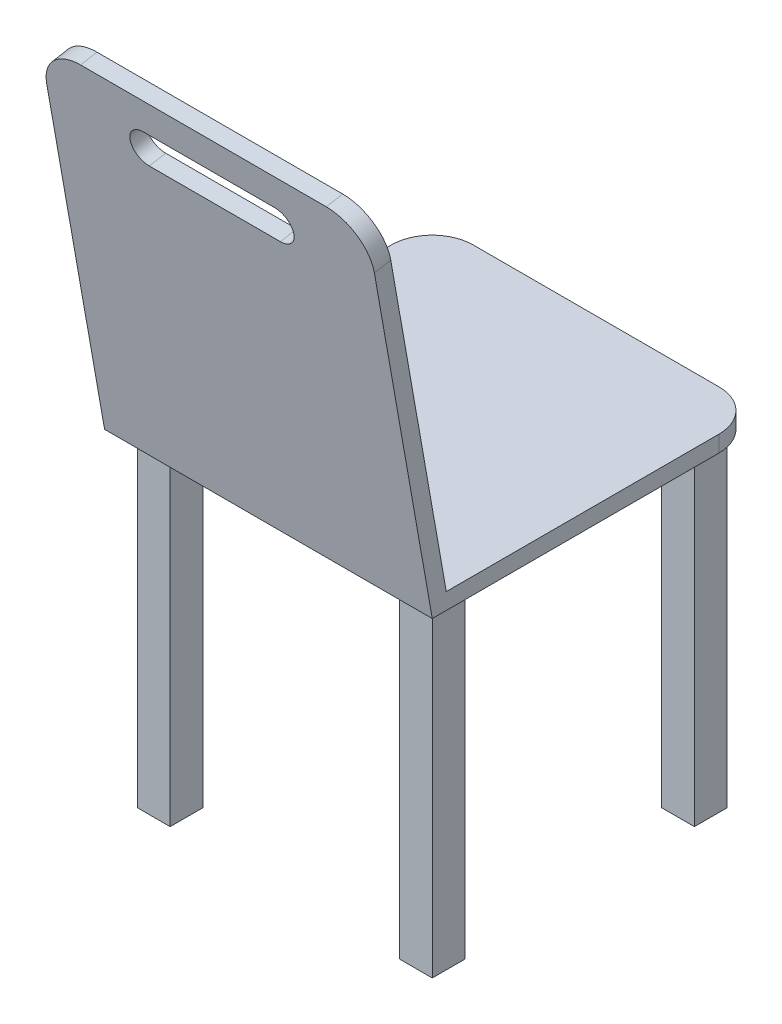
ISO-10303-21;
HEADER;
FILE_DESCRIPTION(('STEP AP214'),'2;1');
FILE_NAME('part.step','',(''),(''),'','','');
FILE_SCHEMA(('AUTOMOTIVE_DESIGN { 1 0 10303 214 1 1 1 1 }'));
ENDSEC;
DATA;
#1=APPLICATION_CONTEXT('core data for automotive mechanical design processes');
#2=APPLICATION_PROTOCOL_DEFINITION('international standard','automotive_design',2000,#1);
#3=PRODUCT_CONTEXT('',#1,'mechanical');
#4=PRODUCT('Part','Part','',(#3));
#5=PRODUCT_RELATED_PRODUCT_CATEGORY('part','',(#4));
#6=PRODUCT_DEFINITION_FORMATION('','',#4);
#7=PRODUCT_DEFINITION_CONTEXT('part definition',#1,'design');
#8=PRODUCT_DEFINITION('design','',#6,#7);
#9=PRODUCT_DEFINITION_SHAPE('','',#8);
#10=(LENGTH_UNIT() NAMED_UNIT(*) SI_UNIT(.MILLI.,.METRE.));
#11=(NAMED_UNIT(*) PLANE_ANGLE_UNIT() SI_UNIT($,.RADIAN.));
#12=(NAMED_UNIT(*) SI_UNIT($,.STERADIAN.) SOLID_ANGLE_UNIT());
#13=UNCERTAINTY_MEASURE_WITH_UNIT(LENGTH_MEASURE(1.E-05),#10,'distance_accuracy_value','');
#14=(GEOMETRIC_REPRESENTATION_CONTEXT(3) GLOBAL_UNCERTAINTY_ASSIGNED_CONTEXT((#13)) GLOBAL_UNIT_ASSIGNED_CONTEXT((#10,
#11,#12)) REPRESENTATION_CONTEXT('',''));
#15=CARTESIAN_POINT('',(0.,0.,0.));
#16=DIRECTION('',(0.,0.,1.));
#17=DIRECTION('',(1.,0.,0.));
#18=AXIS2_PLACEMENT_3D('',#15,#16,#17);
#19=CARTESIAN_POINT('',(400.,453.526539614169,59.3471413188079));
#20=DIRECTION('',(0.,-0.173648177666927,0.984807753012209));
#21=DIRECTION('',(0.,-0.984807753012209,-0.173648177666927));
#22=AXIS2_PLACEMENT_3D('',#19,#20,#21);
#23=PLANE('',#22);
#24=DIRECTION('',(0.,0.984807753012209,0.173648177666927));
#25=VECTOR('',#24,1.);
#26=CARTESIAN_POINT('',(0.,453.526539614169,59.3471413188079));
#27=LINE('',#26,#25);
#28=CARTESIAN_POINT('',(0.,20.,-17.095284468346));
#29=VERTEX_POINT('',#28);
#30=CARTESIAN_POINT('',(0.,404.286151963559,50.6647324354615));
#31=VERTEX_POINT('',#30);
#32=EDGE_CURVE('E410',#29,#31,#27,.T.);
#33=ORIENTED_EDGE('',*,*,#32,.T.);
#34=CARTESIAN_POINT('',(50.,404.286151963559,50.6647324354615));
#35=DIRECTION('',(0.,-0.173648177666927,0.984807753012209));
#36=DIRECTION('',(0.,-0.984807753012209,-0.173648177666927));
#37=AXIS2_PLACEMENT_3D('',#34,#35,#36);
#38=CIRCLE('',#37,50.);
#39=CARTESIAN_POINT('',(50.,453.526539614169,59.3471413188079));
#40=VERTEX_POINT('',#39);
#41=EDGE_CURVE('E454',#31,#40,#38,.F.);
#42=ORIENTED_EDGE('',*,*,#41,.T.);
#43=DIRECTION('',(-1.,0.,0.));
#44=VECTOR('',#43,1.);
#45=CARTESIAN_POINT('',(400.,453.526539614169,59.3471413188079));
#46=LINE('',#45,#44);
#47=CARTESIAN_POINT('',(350.,453.526539614169,59.3471413188079));
#48=VERTEX_POINT('',#47);
#49=EDGE_CURVE('E419',#48,#40,#46,.T.);
#50=ORIENTED_EDGE('',*,*,#49,.F.);
#51=CARTESIAN_POINT('',(350.,404.286151963559,50.6647324354615));
#52=DIRECTION('',(0.,-0.173648177666927,0.984807753012209));
#53=DIRECTION('',(0.,-0.984807753012209,-0.173648177666927));
#54=AXIS2_PLACEMENT_3D('',#51,#52,#53);
#55=CIRCLE('',#54,50.);
#56=CARTESIAN_POINT('',(400.,404.286151963559,50.6647324354615));
#57=VERTEX_POINT('',#56);
#58=EDGE_CURVE('E445',#48,#57,#55,.F.);
#59=ORIENTED_EDGE('',*,*,#58,.T.);
#60=DIRECTION('',(0.,0.984807753012209,0.173648177666927));
#61=VECTOR('',#60,1.);
#62=CARTESIAN_POINT('',(400.,453.526539614169,59.3471413188079));
#63=LINE('',#62,#61);
#64=CARTESIAN_POINT('',(400.,20.,-17.095284468346));
#65=VERTEX_POINT('',#64);
#66=EDGE_CURVE('E400',#65,#57,#63,.T.);
#67=ORIENTED_EDGE('',*,*,#66,.F.);
#68=DIRECTION('',(-1.,0.,0.));
#69=VECTOR('',#68,1.);
#70=CARTESIAN_POINT('',(400.,20.,-17.095284468346));
#71=LINE('',#70,#69);
#72=EDGE_CURVE('E422',#65,#29,#71,.T.);
#73=ORIENTED_EDGE('',*,*,#72,.T.);
#74=EDGE_LOOP('',(#33,#42,#50,#59,#67,#73));
#75=FACE_BOUND('',#74,.T.);
#76=CARTESIAN_POINT('',(280.,394.438074433437,48.9282506587922));
#77=DIRECTION('',(0.,-0.173648177666927,0.984807753012209));
#78=DIRECTION('',(0.,-0.984807753012209,-0.173648177666927));
#79=AXIS2_PLACEMENT_3D('',#76,#77,#78);
#80=CIRCLE('',#79,20.);
#81=CARTESIAN_POINT('',(280.,374.741919373192,45.4552871054537));
#82=VERTEX_POINT('',#81);
#83=CARTESIAN_POINT('',(280.,414.134229493681,52.4012142121308));
#84=VERTEX_POINT('',#83);
#85=EDGE_CURVE('E232',#82,#84,#80,.T.);
#86=ORIENTED_EDGE('',*,*,#85,.T.);
#87=DIRECTION('',(-1.,0.,0.));
#88=VECTOR('',#87,1.);
#89=CARTESIAN_POINT('',(280.,414.134229493681,52.4012142121308));
#90=LINE('',#89,#88);
#91=CARTESIAN_POINT('',(120.,414.134229493681,52.4012142121308));
#92=VERTEX_POINT('',#91);
#93=EDGE_CURVE('E242',#84,#92,#90,.T.);
#94=ORIENTED_EDGE('',*,*,#93,.T.);
#95=CARTESIAN_POINT('',(120.,394.438074433437,48.9282506587922));
#96=DIRECTION('',(0.,0.173648177666927,-0.984807753012209));
#97=DIRECTION('',(0.,0.984807753012209,0.173648177666927));
#98=AXIS2_PLACEMENT_3D('',#95,#96,#97);
#99=CIRCLE('',#98,20.);
#100=CARTESIAN_POINT('',(120.,374.741919373193,45.4552871054537));
#101=VERTEX_POINT('',#100);
#102=EDGE_CURVE('E248',#101,#92,#99,.T.);
#103=ORIENTED_EDGE('',*,*,#102,.F.);
#104=DIRECTION('',(-1.,0.,0.));
#105=VECTOR('',#104,1.);
#106=CARTESIAN_POINT('',(280.,374.741919373192,45.4552871054537));
#107=LINE('',#106,#105);
#108=EDGE_CURVE('E252',#82,#101,#107,.T.);
#109=ORIENTED_EDGE('',*,*,#108,.F.);
#110=EDGE_LOOP('',(#86,#94,#103,#109));
#111=FACE_BOUND('',#110,.T.);
#112=ADVANCED_FACE('F33',(#75,#111),#23,.F.);
#113=CARTESIAN_POINT('',(400.,0.,0.));
#114=DIRECTION('',(0.,0.173648177666927,-0.984807753012209));
#115=DIRECTION('',(0.,0.984807753012209,0.173648177666927));
#116=AXIS2_PLACEMENT_3D('',#113,#114,#115);
#117=PLANE('',#116);
#118=DIRECTION('',(-1.,0.,0.));
#119=VECTOR('',#118,1.);
#120=CARTESIAN_POINT('',(400.,450.,79.3471413188079));
#121=LINE('',#120,#119);
#122=CARTESIAN_POINT('',(350.,450.,79.3471413188079));
#123=VERTEX_POINT('',#122);
#124=CARTESIAN_POINT('',(50.,450.,79.3471413188079));
#125=VERTEX_POINT('',#124);
#126=EDGE_CURVE('E416',#123,#125,#121,.T.);
#127=ORIENTED_EDGE('',*,*,#126,.T.);
#128=CARTESIAN_POINT('',(50.,400.759612349389,70.6647324354615));
#129=DIRECTION('',(0.,0.173648177666927,-0.984807753012209));
#130=DIRECTION('',(0.,0.984807753012209,0.173648177666927));
#131=AXIS2_PLACEMENT_3D('',#128,#129,#130);
#132=CIRCLE('',#131,50.);
#133=CARTESIAN_POINT('',(0.,400.759612349389,70.6647324354615));
#134=VERTEX_POINT('',#133);
#135=EDGE_CURVE('E450',#125,#134,#132,.F.);
#136=ORIENTED_EDGE('',*,*,#135,.T.);
#137=DIRECTION('',(0.,-0.984807753012209,-0.173648177666927));
#138=VECTOR('',#137,1.);
#139=CARTESIAN_POINT('',(0.,0.,0.));
#140=LINE('',#139,#138);
#141=CARTESIAN_POINT('',(0.,0.,0.));
#142=VERTEX_POINT('',#141);
#143=EDGE_CURVE('E398',#134,#142,#140,.T.);
#144=ORIENTED_EDGE('',*,*,#143,.T.);
#145=DIRECTION('',(-1.,0.,0.));
#146=VECTOR('',#145,1.);
#147=CARTESIAN_POINT('',(400.,0.,0.));
#148=LINE('',#147,#146);
#149=CARTESIAN_POINT('',(400.,0.,0.));
#150=VERTEX_POINT('',#149);
#151=EDGE_CURVE('E405',#150,#142,#148,.T.);
#152=ORIENTED_EDGE('',*,*,#151,.F.);
#153=DIRECTION('',(0.,-0.984807753012209,-0.173648177666927));
#154=VECTOR('',#153,1.);
#155=CARTESIAN_POINT('',(400.,0.,0.));
#156=LINE('',#155,#154);
#157=CARTESIAN_POINT('',(400.,400.759612349389,70.6647324354615));
#158=VERTEX_POINT('',#157);
#159=EDGE_CURVE('E403',#158,#150,#156,.T.);
#160=ORIENTED_EDGE('',*,*,#159,.F.);
#161=CARTESIAN_POINT('',(350.,400.759612349389,70.6647324354615));
#162=DIRECTION('',(0.,0.173648177666927,-0.984807753012209));
#163=DIRECTION('',(0.,0.984807753012209,0.173648177666927));
#164=AXIS2_PLACEMENT_3D('',#161,#162,#163);
#165=CIRCLE('',#164,50.);
#166=EDGE_CURVE('E441',#158,#123,#165,.F.);
#167=ORIENTED_EDGE('',*,*,#166,.T.);
#168=EDGE_LOOP('',(#127,#136,#144,#152,#160,#167));
#169=FACE_BOUND('',#168,.T.);
#170=CARTESIAN_POINT('',(280.,390.911534819267,68.9282506587922));
#171=DIRECTION('',(0.,0.173648177666927,-0.984807753012209));
#172=DIRECTION('',(0.,0.984807753012209,0.173648177666927));
#173=AXIS2_PLACEMENT_3D('',#170,#171,#172);
#174=CIRCLE('',#173,20.);
#175=CARTESIAN_POINT('',(280.,371.215379759023,65.4552871054537));
#176=VERTEX_POINT('',#175);
#177=CARTESIAN_POINT('',(280.,410.607689879512,72.4012142121308));
#178=VERTEX_POINT('',#177);
#179=EDGE_CURVE('E235',#176,#178,#174,.F.);
#180=ORIENTED_EDGE('',*,*,#179,.F.);
#181=DIRECTION('',(-1.,0.,0.));
#182=VECTOR('',#181,1.);
#183=CARTESIAN_POINT('',(400.,371.215379759023,65.4552871054536));
#184=LINE('',#183,#182);
#185=CARTESIAN_POINT('',(120.,371.215379759023,65.4552871054537));
#186=VERTEX_POINT('',#185);
#187=EDGE_CURVE('E429',#176,#186,#184,.T.);
#188=ORIENTED_EDGE('',*,*,#187,.T.);
#189=CARTESIAN_POINT('',(120.,390.911534819267,68.9282506587922));
#190=DIRECTION('',(0.,0.173648177666927,-0.984807753012209));
#191=DIRECTION('',(0.,0.984807753012209,0.173648177666927));
#192=AXIS2_PLACEMENT_3D('',#189,#190,#191);
#193=CIRCLE('',#192,20.);
#194=CARTESIAN_POINT('',(120.,410.607689879512,72.4012142121308));
#195=VERTEX_POINT('',#194);
#196=EDGE_CURVE('E432',#186,#195,#193,.T.);
#197=ORIENTED_EDGE('',*,*,#196,.T.);
#198=DIRECTION('',(-1.,0.,0.));
#199=VECTOR('',#198,1.);
#200=CARTESIAN_POINT('',(400.,410.607689879512,72.4012142121308));
#201=LINE('',#200,#199);
#202=EDGE_CURVE('E435',#178,#195,#201,.T.);
#203=ORIENTED_EDGE('',*,*,#202,.F.);
#204=EDGE_LOOP('',(#180,#188,#197,#203));
#205=FACE_BOUND('',#204,.T.);
#206=ADVANCED_FACE('F490',(#169,#205),#117,.F.);
#207=CARTESIAN_POINT('',(400.,0.,0.));
#208=DIRECTION('',(0.,1.,0.));
#209=DIRECTION('',(0.,0.,1.));
#210=AXIS2_PLACEMENT_3D('',#207,#208,#209);
#211=PLANE('',#210);
#212=DIRECTION('',(0.,0.,1.));
#213=VECTOR('',#212,1.);
#214=CARTESIAN_POINT('',(340.,0.,-340.));
#215=LINE('',#214,#213);
#216=CARTESIAN_POINT('',(340.,0.,-380.));
#217=VERTEX_POINT('',#216);
#218=CARTESIAN_POINT('',(340.,0.,-340.));
#219=VERTEX_POINT('',#218);
#220=EDGE_CURVE('E266',#217,#219,#215,.T.);
#221=ORIENTED_EDGE('',*,*,#220,.T.);
#222=DIRECTION('',(1.,0.,0.));
#223=VECTOR('',#222,1.);
#224=CARTESIAN_POINT('',(380.,0.,-340.));
#225=LINE('',#224,#223);
#226=CARTESIAN_POINT('',(380.,0.,-340.));
#227=VERTEX_POINT('',#226);
#228=EDGE_CURVE('E238',#219,#227,#225,.T.);
#229=ORIENTED_EDGE('',*,*,#228,.T.);
#230=DIRECTION('',(0.,0.,-1.));
#231=VECTOR('',#230,1.);
#232=CARTESIAN_POINT('',(380.,0.,-380.));
#233=LINE('',#232,#231);
#234=CARTESIAN_POINT('',(380.,0.,-380.));
#235=VERTEX_POINT('',#234);
#236=EDGE_CURVE('E278',#227,#235,#233,.T.);
#237=ORIENTED_EDGE('',*,*,#236,.T.);
#238=DIRECTION('',(-1.,0.,0.));
#239=VECTOR('',#238,1.);
#240=CARTESIAN_POINT('',(340.,0.,-380.));
#241=LINE('',#240,#239);
#242=EDGE_CURVE('E281',#235,#217,#241,.T.);
#243=ORIENTED_EDGE('',*,*,#242,.T.);
#244=EDGE_LOOP('',(#221,#229,#237,#243));
#245=FACE_BOUND('',#244,.T.);
#246=DIRECTION('',(0.,0.,1.));
#247=VECTOR('',#246,1.);
#248=CARTESIAN_POINT('',(20.,0.,-340.));
#249=LINE('',#248,#247);
#250=CARTESIAN_POINT('',(20.,0.,-380.));
#251=VERTEX_POINT('',#250);
#252=CARTESIAN_POINT('',(20.,0.,-340.));
#253=VERTEX_POINT('',#252);
#254=EDGE_CURVE('E299',#251,#253,#249,.T.);
#255=ORIENTED_EDGE('',*,*,#254,.T.);
#256=DIRECTION('',(1.,0.,0.));
#257=VECTOR('',#256,1.);
#258=CARTESIAN_POINT('',(60.,0.,-340.));
#259=LINE('',#258,#257);
#260=CARTESIAN_POINT('',(60.,0.,-340.));
#261=VERTEX_POINT('',#260);
#262=EDGE_CURVE('E288',#253,#261,#259,.T.);
#263=ORIENTED_EDGE('',*,*,#262,.T.);
#264=DIRECTION('',(0.,0.,-1.));
#265=VECTOR('',#264,1.);
#266=CARTESIAN_POINT('',(60.,0.,-380.));
#267=LINE('',#266,#265);
#268=CARTESIAN_POINT('',(59.9999999999999,0.,-380.));
#269=VERTEX_POINT('',#268);
#270=EDGE_CURVE('E311',#261,#269,#267,.T.);
#271=ORIENTED_EDGE('',*,*,#270,.T.);
#272=DIRECTION('',(-1.,0.,0.));
#273=VECTOR('',#272,1.);
#274=CARTESIAN_POINT('',(20.,0.,-380.));
#275=LINE('',#274,#273);
#276=EDGE_CURVE('E314',#269,#251,#275,.T.);
#277=ORIENTED_EDGE('',*,*,#276,.T.);
#278=EDGE_LOOP('',(#255,#263,#271,#277));
#279=FACE_BOUND('',#278,.T.);
#280=DIRECTION('',(0.,0.,1.));
#281=VECTOR('',#280,1.);
#282=CARTESIAN_POINT('',(340.,0.,-20.));
#283=LINE('',#282,#281);
#284=CARTESIAN_POINT('',(340.,0.,-60.));
#285=VERTEX_POINT('',#284);
#286=CARTESIAN_POINT('',(340.,0.,-20.));
#287=VERTEX_POINT('',#286);
#288=EDGE_CURVE('E332',#285,#287,#283,.T.);
#289=ORIENTED_EDGE('',*,*,#288,.T.);
#290=DIRECTION('',(1.,0.,0.));
#291=VECTOR('',#290,1.);
#292=CARTESIAN_POINT('',(380.,0.,-20.));
#293=LINE('',#292,#291);
#294=CARTESIAN_POINT('',(380.,0.,-20.));
#295=VERTEX_POINT('',#294);
#296=EDGE_CURVE('E321',#287,#295,#293,.T.);
#297=ORIENTED_EDGE('',*,*,#296,.T.);
#298=DIRECTION('',(0.,0.,-1.));
#299=VECTOR('',#298,1.);
#300=CARTESIAN_POINT('',(380.,0.,-60.));
#301=LINE('',#300,#299);
#302=CARTESIAN_POINT('',(380.,0.,-60.));
#303=VERTEX_POINT('',#302);
#304=EDGE_CURVE('E344',#295,#303,#301,.T.);
#305=ORIENTED_EDGE('',*,*,#304,.T.);
#306=DIRECTION('',(-1.,0.,0.));
#307=VECTOR('',#306,1.);
#308=CARTESIAN_POINT('',(340.,0.,-60.));
#309=LINE('',#308,#307);
#310=EDGE_CURVE('E347',#303,#285,#309,.T.);
#311=ORIENTED_EDGE('',*,*,#310,.T.);
#312=EDGE_LOOP('',(#289,#297,#305,#311));
#313=FACE_BOUND('',#312,.T.);
#314=DIRECTION('',(0.,0.,1.));
#315=VECTOR('',#314,1.);
#316=CARTESIAN_POINT('',(20.,0.,-20.));
#317=LINE('',#316,#315);
#318=CARTESIAN_POINT('',(20.,0.,-60.));
#319=VERTEX_POINT('',#318);
#320=CARTESIAN_POINT('',(20.,0.,-20.));
#321=VERTEX_POINT('',#320);
#322=EDGE_CURVE('E365',#319,#321,#317,.T.);
#323=ORIENTED_EDGE('',*,*,#322,.T.);
#324=DIRECTION('',(1.,0.,0.));
#325=VECTOR('',#324,1.);
#326=CARTESIAN_POINT('',(60.,0.,-20.));
#327=LINE('',#326,#325);
#328=CARTESIAN_POINT('',(60.,0.,-20.));
#329=VERTEX_POINT('',#328);
#330=EDGE_CURVE('E354',#321,#329,#327,.T.);
#331=ORIENTED_EDGE('',*,*,#330,.T.);
#332=DIRECTION('',(0.,0.,-1.));
#333=VECTOR('',#332,1.);
#334=CARTESIAN_POINT('',(60.,0.,-60.));
#335=LINE('',#334,#333);
#336=CARTESIAN_POINT('',(59.9999999999999,0.,-60.));
#337=VERTEX_POINT('',#336);
#338=EDGE_CURVE('E377',#329,#337,#335,.T.);
#339=ORIENTED_EDGE('',*,*,#338,.T.);
#340=DIRECTION('',(-1.,0.,0.));
#341=VECTOR('',#340,1.);
#342=CARTESIAN_POINT('',(20.,0.,-60.));
#343=LINE('',#342,#341);
#344=EDGE_CURVE('E380',#337,#319,#343,.T.);
#345=ORIENTED_EDGE('',*,*,#344,.T.);
#346=EDGE_LOOP('',(#323,#331,#339,#345));
#347=FACE_BOUND('',#346,.T.);
#348=DIRECTION('',(-1.,0.,0.));
#349=VECTOR('',#348,1.);
#350=CARTESIAN_POINT('',(400.,0.,-400.));
#351=LINE('',#350,#349);
#352=CARTESIAN_POINT('',(350.,0.,-400.));
#353=VERTEX_POINT('',#352);
#354=CARTESIAN_POINT('',(50.,0.,-400.));
#355=VERTEX_POINT('',#354);
#356=EDGE_CURVE('E427',#353,#355,#351,.T.);
#357=ORIENTED_EDGE('',*,*,#356,.F.);
#358=CARTESIAN_POINT('',(350.,0.,-350.));
#359=DIRECTION('',(0.,1.,0.));
#360=DIRECTION('',(0.,0.,1.));
#361=AXIS2_PLACEMENT_3D('',#358,#359,#360);
#362=CIRCLE('',#361,50.);
#363=CARTESIAN_POINT('',(400.,0.,-350.));
#364=VERTEX_POINT('',#363);
#365=EDGE_CURVE('E11',#353,#364,#362,.F.);
#366=ORIENTED_EDGE('',*,*,#365,.T.);
#367=DIRECTION('',(0.,0.,-1.));
#368=VECTOR('',#367,1.);
#369=CARTESIAN_POINT('',(400.,0.,0.));
#370=LINE('',#369,#368);
#371=EDGE_CURVE('E394',#150,#364,#370,.T.);
#372=ORIENTED_EDGE('',*,*,#371,.F.);
#373=ORIENTED_EDGE('',*,*,#151,.T.);
#374=DIRECTION('',(0.,0.,-1.));
#375=VECTOR('',#374,1.);
#376=CARTESIAN_POINT('',(0.,0.,0.));
#377=LINE('',#376,#375);
#378=CARTESIAN_POINT('',(0.,0.,-350.));
#379=VERTEX_POINT('',#378);
#380=EDGE_CURVE('E387',#142,#379,#377,.T.);
#381=ORIENTED_EDGE('',*,*,#380,.T.);
#382=CARTESIAN_POINT('',(50.,0.,-350.));
#383=DIRECTION('',(0.,1.,0.));
#384=DIRECTION('',(0.,0.,1.));
#385=AXIS2_PLACEMENT_3D('',#382,#383,#384);
#386=CIRCLE('',#385,50.);
#387=EDGE_CURVE('E463',#379,#355,#386,.F.);
#388=ORIENTED_EDGE('',*,*,#387,.T.);
#389=EDGE_LOOP('',(#357,#366,#372,#373,#381,#388));
#390=FACE_BOUND('',#389,.T.);
#391=ADVANCED_FACE('F507',(#245,#279,#313,#347,#390),#211,.F.);
#392=CARTESIAN_POINT('',(400.,0.,-400.));
#393=DIRECTION('',(0.,0.,1.));
#394=DIRECTION('',(1.,0.,0.));
#395=AXIS2_PLACEMENT_3D('',#392,#393,#394);
#396=PLANE('',#395);
#397=DIRECTION('',(-1.,0.,0.));
#398=VECTOR('',#397,1.);
#399=CARTESIAN_POINT('',(400.,20.,-400.));
#400=LINE('',#399,#398);
#401=CARTESIAN_POINT('',(350.,20.,-400.));
#402=VERTEX_POINT('',#401);
#403=CARTESIAN_POINT('',(50.,20.,-400.));
#404=VERTEX_POINT('',#403);
#405=EDGE_CURVE('E425',#402,#404,#400,.T.);
#406=ORIENTED_EDGE('',*,*,#405,.F.);
#407=DIRECTION('',(0.,1.,0.));
#408=VECTOR('',#407,1.);
#409=CARTESIAN_POINT('',(350.,0.,-400.));
#410=LINE('',#409,#408);
#411=EDGE_CURVE('E41',#402,#353,#410,.F.);
#412=ORIENTED_EDGE('',*,*,#411,.T.);
#413=ORIENTED_EDGE('',*,*,#356,.T.);
#414=DIRECTION('',(0.,1.,0.));
#415=VECTOR('',#414,1.);
#416=CARTESIAN_POINT('',(50.,0.,-400.));
#417=LINE('',#416,#415);
#418=EDGE_CURVE('E456',#355,#404,#417,.T.);
#419=ORIENTED_EDGE('',*,*,#418,.T.);
#420=EDGE_LOOP('',(#406,#412,#413,#419));
#421=FACE_BOUND('',#420,.T.);
#422=ADVANCED_FACE('F512',(#421),#396,.F.);
#423=CARTESIAN_POINT('',(400.,20.,-17.095284468346));
#424=DIRECTION('',(0.,-1.,0.));
#425=DIRECTION('',(0.,0.,-1.));
#426=AXIS2_PLACEMENT_3D('',#423,#424,#425);
#427=PLANE('',#426);
#428=DIRECTION('',(0.,0.,1.));
#429=VECTOR('',#428,1.);
#430=CARTESIAN_POINT('',(400.,20.,-17.095284468346));
#431=LINE('',#430,#429);
#432=CARTESIAN_POINT('',(400.,20.,-350.));
#433=VERTEX_POINT('',#432);
#434=EDGE_CURVE('E397',#433,#65,#431,.T.);
#435=ORIENTED_EDGE('',*,*,#434,.F.);
#436=CARTESIAN_POINT('',(350.,20.,-350.));
#437=DIRECTION('',(0.,-1.,0.));
#438=DIRECTION('',(0.,0.,-1.));
#439=AXIS2_PLACEMENT_3D('',#436,#437,#438);
#440=CIRCLE('',#439,50.);
#441=EDGE_CURVE('E55',#433,#402,#440,.F.);
#442=ORIENTED_EDGE('',*,*,#441,.T.);
#443=ORIENTED_EDGE('',*,*,#405,.T.);
#444=CARTESIAN_POINT('',(50.,20.,-350.));
#445=DIRECTION('',(0.,-1.,0.));
#446=DIRECTION('',(0.,0.,-1.));
#447=AXIS2_PLACEMENT_3D('',#444,#445,#446);
#448=CIRCLE('',#447,50.);
#449=CARTESIAN_POINT('',(0.,20.,-350.));
#450=VERTEX_POINT('',#449);
#451=EDGE_CURVE('E459',#404,#450,#448,.F.);
#452=ORIENTED_EDGE('',*,*,#451,.T.);
#453=DIRECTION('',(0.,0.,1.));
#454=VECTOR('',#453,1.);
#455=CARTESIAN_POINT('',(0.,20.,-17.095284468346));
#456=LINE('',#455,#454);
#457=EDGE_CURVE('E408',#450,#29,#456,.T.);
#458=ORIENTED_EDGE('',*,*,#457,.T.);
#459=ORIENTED_EDGE('',*,*,#72,.F.);
#460=EDGE_LOOP('',(#435,#442,#443,#452,#458,#459));
#461=FACE_BOUND('',#460,.T.);
#462=ADVANCED_FACE('F476',(#461),#427,.F.);
#463=CARTESIAN_POINT('',(400.,450.,79.3471413188079));
#464=DIRECTION('',(0.,-0.984807753012209,-0.173648177666926));
#465=DIRECTION('',(0.,0.173648177666926,-0.984807753012209));
#466=AXIS2_PLACEMENT_3D('',#463,#464,#465);
#467=PLANE('',#466);
#468=ORIENTED_EDGE('',*,*,#49,.T.);
#469=DIRECTION('',(0.,-0.173648177666926,0.984807753012209));
#470=VECTOR('',#469,1.);
#471=CARTESIAN_POINT('',(50.,450.,79.3471413188079));
#472=LINE('',#471,#470);
#473=EDGE_CURVE('E447',#40,#125,#472,.T.);
#474=ORIENTED_EDGE('',*,*,#473,.T.);
#475=ORIENTED_EDGE('',*,*,#126,.F.);
#476=DIRECTION('',(0.,-0.173648177666926,0.984807753012209));
#477=VECTOR('',#476,1.);
#478=CARTESIAN_POINT('',(350.,453.526539614169,59.3471413188079));
#479=LINE('',#478,#477);
#480=EDGE_CURVE('E443',#123,#48,#479,.F.);
#481=ORIENTED_EDGE('',*,*,#480,.T.);
#482=EDGE_LOOP('',(#468,#474,#475,#481));
#483=FACE_BOUND('',#482,.T.);
#484=ADVANCED_FACE('F494',(#483),#467,.F.);
#485=CARTESIAN_POINT('',(400.,0.,0.));
#486=DIRECTION('',(1.,0.,0.));
#487=DIRECTION('',(0.,0.,-1.));
#488=AXIS2_PLACEMENT_3D('',#485,#486,#487);
#489=PLANE('',#488);
#490=ORIENTED_EDGE('',*,*,#371,.T.);
#491=DIRECTION('',(0.,1.,0.));
#492=VECTOR('',#491,1.);
#493=CARTESIAN_POINT('',(400.,20.,-350.));
#494=LINE('',#493,#492);
#495=EDGE_CURVE('E466',#364,#433,#494,.T.);
#496=ORIENTED_EDGE('',*,*,#495,.T.);
#497=ORIENTED_EDGE('',*,*,#434,.T.);
#498=ORIENTED_EDGE('',*,*,#66,.T.);
#499=DIRECTION('',(0.,-0.173648177666926,0.984807753012209));
#500=VECTOR('',#499,1.);
#501=CARTESIAN_POINT('',(400.,400.759612349389,70.6647324354616));
#502=LINE('',#501,#500);
#503=EDGE_CURVE('E438',#57,#158,#502,.T.);
#504=ORIENTED_EDGE('',*,*,#503,.T.);
#505=ORIENTED_EDGE('',*,*,#159,.T.);
#506=EDGE_LOOP('',(#490,#496,#497,#498,#504,#505));
#507=FACE_BOUND('',#506,.T.);
#508=ADVANCED_FACE('F471',(#507),#489,.T.);
#509=CARTESIAN_POINT('',(0.,0.,0.));
#510=DIRECTION('',(1.,0.,0.));
#511=DIRECTION('',(0.,0.,-1.));
#512=AXIS2_PLACEMENT_3D('',#509,#510,#511);
#513=PLANE('',#512);
#514=ORIENTED_EDGE('',*,*,#457,.F.);
#515=DIRECTION('',(0.,1.,0.));
#516=VECTOR('',#515,1.);
#517=CARTESIAN_POINT('',(0.,0.,-350.));
#518=LINE('',#517,#516);
#519=EDGE_CURVE('E461',#450,#379,#518,.F.);
#520=ORIENTED_EDGE('',*,*,#519,.T.);
#521=ORIENTED_EDGE('',*,*,#380,.F.);
#522=ORIENTED_EDGE('',*,*,#143,.F.);
#523=DIRECTION('',(0.,-0.173648177666926,0.984807753012209));
#524=VECTOR('',#523,1.);
#525=CARTESIAN_POINT('',(0.,400.75961234939,70.6647324354609));
#526=LINE('',#525,#524);
#527=EDGE_CURVE('E452',#134,#31,#526,.F.);
#528=ORIENTED_EDGE('',*,*,#527,.T.);
#529=ORIENTED_EDGE('',*,*,#32,.F.);
#530=EDGE_LOOP('',(#514,#520,#521,#522,#528,#529));
#531=FACE_BOUND('',#530,.T.);
#532=ADVANCED_FACE('F503',(#531),#513,.F.);
#533=CARTESIAN_POINT('',(60.,-400.,-20.));
#534=DIRECTION('',(0.,0.,1.));
#535=DIRECTION('',(1.,0.,0.));
#536=AXIS2_PLACEMENT_3D('',#533,#534,#535);
#537=PLANE('',#536);
#538=ORIENTED_EDGE('',*,*,#330,.F.);
#539=DIRECTION('',(0.,1.,0.));
#540=VECTOR('',#539,1.);
#541=CARTESIAN_POINT('',(20.,-400.,-20.));
#542=LINE('',#541,#540);
#543=CARTESIAN_POINT('',(20.,-400.,-20.));
#544=VERTEX_POINT('',#543);
#545=EDGE_CURVE('E385',#544,#321,#542,.T.);
#546=ORIENTED_EDGE('',*,*,#545,.F.);
#547=DIRECTION('',(1.,0.,0.));
#548=VECTOR('',#547,1.);
#549=CARTESIAN_POINT('',(60.,-400.,-20.));
#550=LINE('',#549,#548);
#551=CARTESIAN_POINT('',(60.,-400.,-20.));
#552=VERTEX_POINT('',#551);
#553=EDGE_CURVE('E361',#544,#552,#550,.T.);
#554=ORIENTED_EDGE('',*,*,#553,.T.);
#555=DIRECTION('',(0.,1.,0.));
#556=VECTOR('',#555,1.);
#557=CARTESIAN_POINT('',(60.,-400.,-20.));
#558=LINE('',#557,#556);
#559=EDGE_CURVE('E374',#552,#329,#558,.T.);
#560=ORIENTED_EDGE('',*,*,#559,.T.);
#561=EDGE_LOOP('',(#538,#546,#554,#560));
#562=FACE_BOUND('',#561,.T.);
#563=ADVANCED_FACE('F589',(#562),#537,.T.);
#564=CARTESIAN_POINT('',(20.,-400.,-20.));
#565=DIRECTION('',(-1.,0.,0.));
#566=DIRECTION('',(0.,0.,1.));
#567=AXIS2_PLACEMENT_3D('',#564,#565,#566);
#568=PLANE('',#567);
#569=ORIENTED_EDGE('',*,*,#322,.F.);
#570=DIRECTION('',(0.,1.,0.));
#571=VECTOR('',#570,1.);
#572=CARTESIAN_POINT('',(20.,-400.,-60.));
#573=LINE('',#572,#571);
#574=CARTESIAN_POINT('',(20.,-400.,-60.));
#575=VERTEX_POINT('',#574);
#576=EDGE_CURVE('E388',#575,#319,#573,.T.);
#577=ORIENTED_EDGE('',*,*,#576,.F.);
#578=DIRECTION('',(0.,0.,1.));
#579=VECTOR('',#578,1.);
#580=CARTESIAN_POINT('',(20.,-400.,-20.));
#581=LINE('',#580,#579);
#582=EDGE_CURVE('E371',#575,#544,#581,.T.);
#583=ORIENTED_EDGE('',*,*,#582,.T.);
#584=ORIENTED_EDGE('',*,*,#545,.T.);
#585=EDGE_LOOP('',(#569,#577,#583,#584));
#586=FACE_BOUND('',#585,.T.);
#587=ADVANCED_FACE('F594',(#586),#568,.T.);
#588=CARTESIAN_POINT('',(20.,-400.,-60.));
#589=DIRECTION('',(0.,0.,-1.));
#590=DIRECTION('',(-1.,0.,0.));
#591=AXIS2_PLACEMENT_3D('',#588,#589,#590);
#592=PLANE('',#591);
#593=ORIENTED_EDGE('',*,*,#344,.F.);
#594=DIRECTION('',(0.,1.,0.));
#595=VECTOR('',#594,1.);
#596=CARTESIAN_POINT('',(60.,-400.,-60.));
#597=LINE('',#596,#595);
#598=CARTESIAN_POINT('',(60.,-400.,-60.));
#599=VERTEX_POINT('',#598);
#600=EDGE_CURVE('E390',#599,#337,#597,.T.);
#601=ORIENTED_EDGE('',*,*,#600,.F.);
#602=DIRECTION('',(-1.,0.,0.));
#603=VECTOR('',#602,1.);
#604=CARTESIAN_POINT('',(20.,-400.,-60.));
#605=LINE('',#604,#603);
#606=EDGE_CURVE('E368',#599,#575,#605,.T.);
#607=ORIENTED_EDGE('',*,*,#606,.T.);
#608=ORIENTED_EDGE('',*,*,#576,.T.);
#609=EDGE_LOOP('',(#593,#601,#607,#608));
#610=FACE_BOUND('',#609,.T.);
#611=ADVANCED_FACE('F602',(#610),#592,.T.);
#612=CARTESIAN_POINT('',(60.,-400.,-60.));
#613=DIRECTION('',(1.,0.,0.));
#614=DIRECTION('',(0.,0.,-1.));
#615=AXIS2_PLACEMENT_3D('',#612,#613,#614);
#616=PLANE('',#615);
#617=ORIENTED_EDGE('',*,*,#338,.F.);
#618=ORIENTED_EDGE('',*,*,#559,.F.);
#619=DIRECTION('',(0.,0.,-1.));
#620=VECTOR('',#619,1.);
#621=CARTESIAN_POINT('',(60.,-400.,-60.));
#622=LINE('',#621,#620);
#623=EDGE_CURVE('E364',#552,#599,#622,.T.);
#624=ORIENTED_EDGE('',*,*,#623,.T.);
#625=ORIENTED_EDGE('',*,*,#600,.T.);
#626=EDGE_LOOP('',(#617,#618,#624,#625));
#627=FACE_BOUND('',#626,.T.);
#628=ADVANCED_FACE('F610',(#627),#616,.T.);
#629=CARTESIAN_POINT('',(0.,-400.,0.));
#630=DIRECTION('',(0.,-1.,0.));
#631=DIRECTION('',(0.,0.,-1.));
#632=AXIS2_PLACEMENT_3D('',#629,#630,#631);
#633=PLANE('',#632);
#634=ORIENTED_EDGE('',*,*,#553,.F.);
#635=ORIENTED_EDGE('',*,*,#582,.F.);
#636=ORIENTED_EDGE('',*,*,#606,.F.);
#637=ORIENTED_EDGE('',*,*,#623,.F.);
#638=EDGE_LOOP('',(#634,#635,#636,#637));
#639=FACE_BOUND('',#638,.T.);
#640=ADVANCED_FACE('F618',(#639),#633,.T.);
#641=CARTESIAN_POINT('',(380.,-400.,-20.));
#642=DIRECTION('',(0.,0.,1.));
#643=DIRECTION('',(1.,0.,0.));
#644=AXIS2_PLACEMENT_3D('',#641,#642,#643);
#645=PLANE('',#644);
#646=ORIENTED_EDGE('',*,*,#296,.F.);
#647=DIRECTION('',(0.,1.,0.));
#648=VECTOR('',#647,1.);
#649=CARTESIAN_POINT('',(340.,-400.,-20.));
#650=LINE('',#649,#648);
#651=CARTESIAN_POINT('',(340.,-400.,-20.));
#652=VERTEX_POINT('',#651);
#653=EDGE_CURVE('E352',#652,#287,#650,.T.);
#654=ORIENTED_EDGE('',*,*,#653,.F.);
#655=DIRECTION('',(1.,0.,0.));
#656=VECTOR('',#655,1.);
#657=CARTESIAN_POINT('',(380.,-400.,-20.));
#658=LINE('',#657,#656);
#659=CARTESIAN_POINT('',(380.,-400.,-20.));
#660=VERTEX_POINT('',#659);
#661=EDGE_CURVE('E328',#652,#660,#658,.T.);
#662=ORIENTED_EDGE('',*,*,#661,.T.);
#663=DIRECTION('',(0.,1.,0.));
#664=VECTOR('',#663,1.);
#665=CARTESIAN_POINT('',(380.,-400.,-20.));
#666=LINE('',#665,#664);
#667=EDGE_CURVE('E341',#660,#295,#666,.T.);
#668=ORIENTED_EDGE('',*,*,#667,.T.);
#669=EDGE_LOOP('',(#646,#654,#662,#668));
#670=FACE_BOUND('',#669,.T.);
#671=ADVANCED_FACE('F626',(#670),#645,.T.);
#672=CARTESIAN_POINT('',(340.,-400.,-20.));
#673=DIRECTION('',(-1.,0.,0.));
#674=DIRECTION('',(0.,0.,1.));
#675=AXIS2_PLACEMENT_3D('',#672,#673,#674);
#676=PLANE('',#675);
#677=ORIENTED_EDGE('',*,*,#288,.F.);
#678=DIRECTION('',(0.,1.,0.));
#679=VECTOR('',#678,1.);
#680=CARTESIAN_POINT('',(340.,-400.,-60.));
#681=LINE('',#680,#679);
#682=CARTESIAN_POINT('',(340.,-400.,-60.));
#683=VERTEX_POINT('',#682);
#684=EDGE_CURVE('E355',#683,#285,#681,.T.);
#685=ORIENTED_EDGE('',*,*,#684,.F.);
#686=DIRECTION('',(0.,0.,1.));
#687=VECTOR('',#686,1.);
#688=CARTESIAN_POINT('',(340.,-400.,-20.));
#689=LINE('',#688,#687);
#690=EDGE_CURVE('E338',#683,#652,#689,.T.);
#691=ORIENTED_EDGE('',*,*,#690,.T.);
#692=ORIENTED_EDGE('',*,*,#653,.T.);
#693=EDGE_LOOP('',(#677,#685,#691,#692));
#694=FACE_BOUND('',#693,.T.);
#695=ADVANCED_FACE('F634',(#694),#676,.T.);
#696=CARTESIAN_POINT('',(340.,-400.,-60.));
#697=DIRECTION('',(0.,0.,-1.));
#698=DIRECTION('',(-1.,0.,0.));
#699=AXIS2_PLACEMENT_3D('',#696,#697,#698);
#700=PLANE('',#699);
#701=ORIENTED_EDGE('',*,*,#310,.F.);
#702=DIRECTION('',(0.,1.,0.));
#703=VECTOR('',#702,1.);
#704=CARTESIAN_POINT('',(380.,-400.,-60.));
#705=LINE('',#704,#703);
#706=CARTESIAN_POINT('',(380.,-400.,-60.));
#707=VERTEX_POINT('',#706);
#708=EDGE_CURVE('E357',#707,#303,#705,.T.);
#709=ORIENTED_EDGE('',*,*,#708,.F.);
#710=DIRECTION('',(-1.,0.,0.));
#711=VECTOR('',#710,1.);
#712=CARTESIAN_POINT('',(340.,-400.,-60.));
#713=LINE('',#712,#711);
#714=EDGE_CURVE('E335',#707,#683,#713,.T.);
#715=ORIENTED_EDGE('',*,*,#714,.T.);
#716=ORIENTED_EDGE('',*,*,#684,.T.);
#717=EDGE_LOOP('',(#701,#709,#715,#716));
#718=FACE_BOUND('',#717,.T.);
#719=ADVANCED_FACE('F642',(#718),#700,.T.);
#720=CARTESIAN_POINT('',(380.,-400.,-60.));
#721=DIRECTION('',(1.,0.,0.));
#722=DIRECTION('',(0.,0.,-1.));
#723=AXIS2_PLACEMENT_3D('',#720,#721,#722);
#724=PLANE('',#723);
#725=ORIENTED_EDGE('',*,*,#304,.F.);
#726=ORIENTED_EDGE('',*,*,#667,.F.);
#727=DIRECTION('',(0.,0.,-1.));
#728=VECTOR('',#727,1.);
#729=CARTESIAN_POINT('',(380.,-400.,-60.));
#730=LINE('',#729,#728);
#731=EDGE_CURVE('E331',#660,#707,#730,.T.);
#732=ORIENTED_EDGE('',*,*,#731,.T.);
#733=ORIENTED_EDGE('',*,*,#708,.T.);
#734=EDGE_LOOP('',(#725,#726,#732,#733));
#735=FACE_BOUND('',#734,.T.);
#736=ADVANCED_FACE('F650',(#735),#724,.T.);
#737=CARTESIAN_POINT('',(0.,-400.,0.));
#738=DIRECTION('',(0.,-1.,0.));
#739=DIRECTION('',(0.,0.,-1.));
#740=AXIS2_PLACEMENT_3D('',#737,#738,#739);
#741=PLANE('',#740);
#742=ORIENTED_EDGE('',*,*,#661,.F.);
#743=ORIENTED_EDGE('',*,*,#690,.F.);
#744=ORIENTED_EDGE('',*,*,#714,.F.);
#745=ORIENTED_EDGE('',*,*,#731,.F.);
#746=EDGE_LOOP('',(#742,#743,#744,#745));
#747=FACE_BOUND('',#746,.T.);
#748=ADVANCED_FACE('F658',(#747),#741,.T.);
#749=CARTESIAN_POINT('',(60.,-400.,-340.));
#750=DIRECTION('',(0.,0.,1.));
#751=DIRECTION('',(1.,0.,0.));
#752=AXIS2_PLACEMENT_3D('',#749,#750,#751);
#753=PLANE('',#752);
#754=ORIENTED_EDGE('',*,*,#262,.F.);
#755=DIRECTION('',(0.,1.,0.));
#756=VECTOR('',#755,1.);
#757=CARTESIAN_POINT('',(20.,-400.,-340.));
#758=LINE('',#757,#756);
#759=CARTESIAN_POINT('',(20.,-400.,-340.));
#760=VERTEX_POINT('',#759);
#761=EDGE_CURVE('E319',#760,#253,#758,.T.);
#762=ORIENTED_EDGE('',*,*,#761,.F.);
#763=DIRECTION('',(1.,0.,0.));
#764=VECTOR('',#763,1.);
#765=CARTESIAN_POINT('',(60.,-400.,-340.));
#766=LINE('',#765,#764);
#767=CARTESIAN_POINT('',(60.,-400.,-340.));
#768=VERTEX_POINT('',#767);
#769=EDGE_CURVE('E295',#760,#768,#766,.T.);
#770=ORIENTED_EDGE('',*,*,#769,.T.);
#771=DIRECTION('',(0.,1.,0.));
#772=VECTOR('',#771,1.);
#773=CARTESIAN_POINT('',(60.,-400.,-340.));
#774=LINE('',#773,#772);
#775=EDGE_CURVE('E308',#768,#261,#774,.T.);
#776=ORIENTED_EDGE('',*,*,#775,.T.);
#777=EDGE_LOOP('',(#754,#762,#770,#776));
#778=FACE_BOUND('',#777,.T.);
#779=ADVANCED_FACE('F666',(#778),#753,.T.);
#780=CARTESIAN_POINT('',(20.,-400.,-340.));
#781=DIRECTION('',(-1.,0.,0.));
#782=DIRECTION('',(0.,0.,1.));
#783=AXIS2_PLACEMENT_3D('',#780,#781,#782);
#784=PLANE('',#783);
#785=ORIENTED_EDGE('',*,*,#254,.F.);
#786=DIRECTION('',(0.,1.,0.));
#787=VECTOR('',#786,1.);
#788=CARTESIAN_POINT('',(20.,-400.,-380.));
#789=LINE('',#788,#787);
#790=CARTESIAN_POINT('',(20.,-400.,-380.));
#791=VERTEX_POINT('',#790);
#792=EDGE_CURVE('E322',#791,#251,#789,.T.);
#793=ORIENTED_EDGE('',*,*,#792,.F.);
#794=DIRECTION('',(0.,0.,1.));
#795=VECTOR('',#794,1.);
#796=CARTESIAN_POINT('',(20.,-400.,-340.));
#797=LINE('',#796,#795);
#798=EDGE_CURVE('E305',#791,#760,#797,.T.);
#799=ORIENTED_EDGE('',*,*,#798,.T.);
#800=ORIENTED_EDGE('',*,*,#761,.T.);
#801=EDGE_LOOP('',(#785,#793,#799,#800));
#802=FACE_BOUND('',#801,.T.);
#803=ADVANCED_FACE('F674',(#802),#784,.T.);
#804=CARTESIAN_POINT('',(20.,-400.,-380.));
#805=DIRECTION('',(0.,0.,-1.));
#806=DIRECTION('',(-1.,0.,0.));
#807=AXIS2_PLACEMENT_3D('',#804,#805,#806);
#808=PLANE('',#807);
#809=ORIENTED_EDGE('',*,*,#276,.F.);
#810=DIRECTION('',(0.,1.,0.));
#811=VECTOR('',#810,1.);
#812=CARTESIAN_POINT('',(60.,-400.,-380.));
#813=LINE('',#812,#811);
#814=CARTESIAN_POINT('',(60.,-400.,-380.));
#815=VERTEX_POINT('',#814);
#816=EDGE_CURVE('E324',#815,#269,#813,.T.);
#817=ORIENTED_EDGE('',*,*,#816,.F.);
#818=DIRECTION('',(-1.,0.,0.));
#819=VECTOR('',#818,1.);
#820=CARTESIAN_POINT('',(20.,-400.,-380.));
#821=LINE('',#820,#819);
#822=EDGE_CURVE('E302',#815,#791,#821,.T.);
#823=ORIENTED_EDGE('',*,*,#822,.T.);
#824=ORIENTED_EDGE('',*,*,#792,.T.);
#825=EDGE_LOOP('',(#809,#817,#823,#824));
#826=FACE_BOUND('',#825,.T.);
#827=ADVANCED_FACE('F682',(#826),#808,.T.);
#828=CARTESIAN_POINT('',(60.,-400.,-380.));
#829=DIRECTION('',(1.,0.,0.));
#830=DIRECTION('',(0.,0.,-1.));
#831=AXIS2_PLACEMENT_3D('',#828,#829,#830);
#832=PLANE('',#831);
#833=ORIENTED_EDGE('',*,*,#270,.F.);
#834=ORIENTED_EDGE('',*,*,#775,.F.);
#835=DIRECTION('',(0.,0.,-1.));
#836=VECTOR('',#835,1.);
#837=CARTESIAN_POINT('',(60.,-400.,-380.));
#838=LINE('',#837,#836);
#839=EDGE_CURVE('E298',#768,#815,#838,.T.);
#840=ORIENTED_EDGE('',*,*,#839,.T.);
#841=ORIENTED_EDGE('',*,*,#816,.T.);
#842=EDGE_LOOP('',(#833,#834,#840,#841));
#843=FACE_BOUND('',#842,.T.);
#844=ADVANCED_FACE('F690',(#843),#832,.T.);
#845=CARTESIAN_POINT('',(0.,-400.,0.));
#846=DIRECTION('',(0.,-1.,0.));
#847=DIRECTION('',(0.,0.,-1.));
#848=AXIS2_PLACEMENT_3D('',#845,#846,#847);
#849=PLANE('',#848);
#850=ORIENTED_EDGE('',*,*,#769,.F.);
#851=ORIENTED_EDGE('',*,*,#798,.F.);
#852=ORIENTED_EDGE('',*,*,#822,.F.);
#853=ORIENTED_EDGE('',*,*,#839,.F.);
#854=EDGE_LOOP('',(#850,#851,#852,#853));
#855=FACE_BOUND('',#854,.T.);
#856=ADVANCED_FACE('F698',(#855),#849,.T.);
#857=CARTESIAN_POINT('',(380.,-400.,-340.));
#858=DIRECTION('',(0.,0.,1.));
#859=DIRECTION('',(1.,0.,0.));
#860=AXIS2_PLACEMENT_3D('',#857,#858,#859);
#861=PLANE('',#860);
#862=ORIENTED_EDGE('',*,*,#228,.F.);
#863=DIRECTION('',(0.,1.,0.));
#864=VECTOR('',#863,1.);
#865=CARTESIAN_POINT('',(340.,-400.,-340.));
#866=LINE('',#865,#864);
#867=CARTESIAN_POINT('',(340.,-400.,-340.));
#868=VERTEX_POINT('',#867);
#869=EDGE_CURVE('E286',#868,#219,#866,.T.);
#870=ORIENTED_EDGE('',*,*,#869,.F.);
#871=DIRECTION('',(1.,0.,0.));
#872=VECTOR('',#871,1.);
#873=CARTESIAN_POINT('',(380.,-400.,-340.));
#874=LINE('',#873,#872);
#875=CARTESIAN_POINT('',(380.,-400.,-340.));
#876=VERTEX_POINT('',#875);
#877=EDGE_CURVE('E262',#868,#876,#874,.T.);
#878=ORIENTED_EDGE('',*,*,#877,.T.);
#879=DIRECTION('',(0.,1.,0.));
#880=VECTOR('',#879,1.);
#881=CARTESIAN_POINT('',(380.,-400.,-340.));
#882=LINE('',#881,#880);
#883=EDGE_CURVE('E275',#876,#227,#882,.T.);
#884=ORIENTED_EDGE('',*,*,#883,.T.);
#885=EDGE_LOOP('',(#862,#870,#878,#884));
#886=FACE_BOUND('',#885,.T.);
#887=ADVANCED_FACE('F706',(#886),#861,.T.);
#888=CARTESIAN_POINT('',(340.,-400.,-340.));
#889=DIRECTION('',(-1.,0.,0.));
#890=DIRECTION('',(0.,0.,1.));
#891=AXIS2_PLACEMENT_3D('',#888,#889,#890);
#892=PLANE('',#891);
#893=ORIENTED_EDGE('',*,*,#220,.F.);
#894=DIRECTION('',(0.,1.,0.));
#895=VECTOR('',#894,1.);
#896=CARTESIAN_POINT('',(340.,-400.,-380.));
#897=LINE('',#896,#895);
#898=CARTESIAN_POINT('',(340.,-400.,-380.));
#899=VERTEX_POINT('',#898);
#900=EDGE_CURVE('E289',#899,#217,#897,.T.);
#901=ORIENTED_EDGE('',*,*,#900,.F.);
#902=DIRECTION('',(0.,0.,1.));
#903=VECTOR('',#902,1.);
#904=CARTESIAN_POINT('',(340.,-400.,-340.));
#905=LINE('',#904,#903);
#906=EDGE_CURVE('E272',#899,#868,#905,.T.);
#907=ORIENTED_EDGE('',*,*,#906,.T.);
#908=ORIENTED_EDGE('',*,*,#869,.T.);
#909=EDGE_LOOP('',(#893,#901,#907,#908));
#910=FACE_BOUND('',#909,.T.);
#911=ADVANCED_FACE('F714',(#910),#892,.T.);
#912=CARTESIAN_POINT('',(340.,-400.,-380.));
#913=DIRECTION('',(0.,0.,-1.));
#914=DIRECTION('',(-1.,0.,0.));
#915=AXIS2_PLACEMENT_3D('',#912,#913,#914);
#916=PLANE('',#915);
#917=ORIENTED_EDGE('',*,*,#242,.F.);
#918=DIRECTION('',(0.,1.,0.));
#919=VECTOR('',#918,1.);
#920=CARTESIAN_POINT('',(380.,-400.,-380.));
#921=LINE('',#920,#919);
#922=CARTESIAN_POINT('',(380.,-400.,-380.));
#923=VERTEX_POINT('',#922);
#924=EDGE_CURVE('E291',#923,#235,#921,.T.);
#925=ORIENTED_EDGE('',*,*,#924,.F.);
#926=DIRECTION('',(-1.,0.,0.));
#927=VECTOR('',#926,1.);
#928=CARTESIAN_POINT('',(340.,-400.,-380.));
#929=LINE('',#928,#927);
#930=EDGE_CURVE('E269',#923,#899,#929,.T.);
#931=ORIENTED_EDGE('',*,*,#930,.T.);
#932=ORIENTED_EDGE('',*,*,#900,.T.);
#933=EDGE_LOOP('',(#917,#925,#931,#932));
#934=FACE_BOUND('',#933,.T.);
#935=ADVANCED_FACE('F722',(#934),#916,.T.);
#936=CARTESIAN_POINT('',(380.,-400.,-380.));
#937=DIRECTION('',(1.,0.,0.));
#938=DIRECTION('',(0.,0.,-1.));
#939=AXIS2_PLACEMENT_3D('',#936,#937,#938);
#940=PLANE('',#939);
#941=ORIENTED_EDGE('',*,*,#236,.F.);
#942=ORIENTED_EDGE('',*,*,#883,.F.);
#943=DIRECTION('',(0.,0.,-1.));
#944=VECTOR('',#943,1.);
#945=CARTESIAN_POINT('',(380.,-400.,-380.));
#946=LINE('',#945,#944);
#947=EDGE_CURVE('E265',#876,#923,#946,.T.);
#948=ORIENTED_EDGE('',*,*,#947,.T.);
#949=ORIENTED_EDGE('',*,*,#924,.T.);
#950=EDGE_LOOP('',(#941,#942,#948,#949));
#951=FACE_BOUND('',#950,.T.);
#952=ADVANCED_FACE('F730',(#951),#940,.T.);
#953=CARTESIAN_POINT('',(0.,-400.,0.));
#954=DIRECTION('',(0.,-1.,0.));
#955=DIRECTION('',(0.,0.,-1.));
#956=AXIS2_PLACEMENT_3D('',#953,#954,#955);
#957=PLANE('',#956);
#958=ORIENTED_EDGE('',*,*,#877,.F.);
#959=ORIENTED_EDGE('',*,*,#906,.F.);
#960=ORIENTED_EDGE('',*,*,#930,.F.);
#961=ORIENTED_EDGE('',*,*,#947,.F.);
#962=EDGE_LOOP('',(#958,#959,#960,#961));
#963=FACE_BOUND('',#962,.T.);
#964=ADVANCED_FACE('F738',(#963),#957,.T.);
#965=CARTESIAN_POINT('',(280.,331.924730473343,403.459041743187));
#966=DIRECTION('',(0.,0.173648177666927,-0.984807753012208));
#967=DIRECTION('',(0.,0.984807753012209,0.173648177666927));
#968=AXIS2_PLACEMENT_3D('',#965,#966,#967);
#969=CYLINDRICAL_SURFACE('',#968,20.);
#970=ORIENTED_EDGE('',*,*,#179,.T.);
#971=DIRECTION('',(0.,0.173648177666927,-0.984807753012208));
#972=VECTOR('',#971,1.);
#973=CARTESIAN_POINT('',(280.,351.620885533587,406.932005296526));
#974=LINE('',#973,#972);
#975=EDGE_CURVE('E227',#178,#84,#974,.T.);
#976=ORIENTED_EDGE('',*,*,#975,.T.);
#977=ORIENTED_EDGE('',*,*,#85,.F.);
#978=DIRECTION('',(0.,0.173648177666927,-0.984807753012208));
#979=VECTOR('',#978,1.);
#980=CARTESIAN_POINT('',(280.,312.228575413099,399.986078189849));
#981=LINE('',#980,#979);
#982=EDGE_CURVE('E257',#176,#82,#981,.T.);
#983=ORIENTED_EDGE('',*,*,#982,.F.);
#984=EDGE_LOOP('',(#970,#976,#977,#983));
#985=FACE_BOUND('',#984,.T.);
#986=ADVANCED_FACE('F229',(#985),#969,.F.);
#987=CARTESIAN_POINT('',(280.,351.620885533587,406.932005296526));
#988=DIRECTION('',(0.,-0.984807753012208,-0.173648177666927));
#989=DIRECTION('',(0.,0.173648177666927,-0.984807753012209));
#990=AXIS2_PLACEMENT_3D('',#987,#988,#989);
#991=PLANE('',#990);
#992=ORIENTED_EDGE('',*,*,#202,.T.);
#993=DIRECTION('',(0.,0.173648177666927,-0.984807753012208));
#994=VECTOR('',#993,1.);
#995=CARTESIAN_POINT('',(120.,351.620885533587,406.932005296526));
#996=LINE('',#995,#994);
#997=EDGE_CURVE('E239',#195,#92,#996,.T.);
#998=ORIENTED_EDGE('',*,*,#997,.T.);
#999=ORIENTED_EDGE('',*,*,#93,.F.);
#1000=ORIENTED_EDGE('',*,*,#975,.F.);
#1001=EDGE_LOOP('',(#992,#998,#999,#1000));
#1002=FACE_BOUND('',#1001,.T.);
#1003=ADVANCED_FACE('F243',(#1002),#991,.T.);
#1004=CARTESIAN_POINT('',(120.,331.924730473343,403.459041743187));
#1005=DIRECTION('',(0.,0.173648177666927,-0.984807753012208));
#1006=DIRECTION('',(0.,0.984807753012209,0.173648177666927));
#1007=AXIS2_PLACEMENT_3D('',#1004,#1005,#1006);
#1008=CYLINDRICAL_SURFACE('',#1007,20.);
#1009=DIRECTION('',(0.,0.173648177666927,-0.984807753012208));
#1010=VECTOR('',#1009,1.);
#1011=CARTESIAN_POINT('',(120.,312.228575413099,399.986078189849));
#1012=LINE('',#1011,#1010);
#1013=EDGE_CURVE('E259',#186,#101,#1012,.T.);
#1014=ORIENTED_EDGE('',*,*,#1013,.T.);
#1015=ORIENTED_EDGE('',*,*,#102,.T.);
#1016=ORIENTED_EDGE('',*,*,#997,.F.);
#1017=ORIENTED_EDGE('',*,*,#196,.F.);
#1018=EDGE_LOOP('',(#1014,#1015,#1016,#1017));
#1019=FACE_BOUND('',#1018,.T.);
#1020=ADVANCED_FACE('F759',(#1019),#1008,.F.);
#1021=CARTESIAN_POINT('',(280.,312.228575413099,399.986078189849));
#1022=DIRECTION('',(0.,-0.984807753012208,-0.173648177666927));
#1023=DIRECTION('',(0.,0.173648177666927,-0.984807753012209));
#1024=AXIS2_PLACEMENT_3D('',#1021,#1022,#1023);
#1025=PLANE('',#1024);
#1026=ORIENTED_EDGE('',*,*,#982,.T.);
#1027=ORIENTED_EDGE('',*,*,#108,.T.);
#1028=ORIENTED_EDGE('',*,*,#1013,.F.);
#1029=ORIENTED_EDGE('',*,*,#187,.F.);
#1030=EDGE_LOOP('',(#1026,#1027,#1028,#1029));
#1031=FACE_BOUND('',#1030,.T.);
#1032=ADVANCED_FACE('F534',(#1031),#1025,.F.);
#1033=CARTESIAN_POINT('',(350.,400.75961234939,70.6647324354609));
#1034=DIRECTION('',(0.,0.173648177666926,-0.984807753012209));
#1035=DIRECTION('',(0.,0.984807753012209,0.173648177666926));
#1036=AXIS2_PLACEMENT_3D('',#1033,#1034,#1035);
#1037=CYLINDRICAL_SURFACE('',#1036,50.);
#1038=ORIENTED_EDGE('',*,*,#58,.F.);
#1039=ORIENTED_EDGE('',*,*,#480,.F.);
#1040=ORIENTED_EDGE('',*,*,#166,.F.);
#1041=ORIENTED_EDGE('',*,*,#503,.F.);
#1042=EDGE_LOOP('',(#1038,#1039,#1040,#1041));
#1043=FACE_BOUND('',#1042,.T.);
#1044=ADVANCED_FACE('F486',(#1043),#1037,.T.);
#1045=CARTESIAN_POINT('',(50.,400.759612349389,70.6647324354616));
#1046=DIRECTION('',(0.,-0.173648177666926,0.984807753012209));
#1047=DIRECTION('',(0.,-0.984807753012209,-0.173648177666926));
#1048=AXIS2_PLACEMENT_3D('',#1045,#1046,#1047);
#1049=CYLINDRICAL_SURFACE('',#1048,50.);
#1050=ORIENTED_EDGE('',*,*,#41,.F.);
#1051=ORIENTED_EDGE('',*,*,#527,.F.);
#1052=ORIENTED_EDGE('',*,*,#135,.F.);
#1053=ORIENTED_EDGE('',*,*,#473,.F.);
#1054=EDGE_LOOP('',(#1050,#1051,#1052,#1053));
#1055=FACE_BOUND('',#1054,.T.);
#1056=ADVANCED_FACE('F498',(#1055),#1049,.T.);
#1057=CARTESIAN_POINT('',(50.,0.,-350.));
#1058=DIRECTION('',(0.,1.,0.));
#1059=DIRECTION('',(0.,0.,1.));
#1060=AXIS2_PLACEMENT_3D('',#1057,#1058,#1059);
#1061=CYLINDRICAL_SURFACE('',#1060,50.);
#1062=ORIENTED_EDGE('',*,*,#387,.F.);
#1063=ORIENTED_EDGE('',*,*,#519,.F.);
#1064=ORIENTED_EDGE('',*,*,#451,.F.);
#1065=ORIENTED_EDGE('',*,*,#418,.F.);
#1066=EDGE_LOOP('',(#1062,#1063,#1064,#1065));
#1067=FACE_BOUND('',#1066,.T.);
#1068=ADVANCED_FACE('F510',(#1067),#1061,.T.);
#1069=CARTESIAN_POINT('',(350.,0.,-350.));
#1070=DIRECTION('',(0.,-1.,0.));
#1071=DIRECTION('',(0.,0.,-1.));
#1072=AXIS2_PLACEMENT_3D('',#1069,#1070,#1071);
#1073=CYLINDRICAL_SURFACE('',#1072,50.);
#1074=ORIENTED_EDGE('',*,*,#365,.F.);
#1075=ORIENTED_EDGE('',*,*,#411,.F.);
#1076=ORIENTED_EDGE('',*,*,#441,.F.);
#1077=ORIENTED_EDGE('',*,*,#495,.F.);
#1078=EDGE_LOOP('',(#1074,#1075,#1076,#1077));
#1079=FACE_BOUND('',#1078,.T.);
#1080=ADVANCED_FACE('F35',(#1079),#1073,.T.);
#1081=CLOSED_SHELL('',(#112,#206,#391,#422,#462,#484,#508,#532,#563,#587,#611,#628,#640,#671,
#695,#719,#736,#748,#779,#803,#827,#844,#856,#887,#911,#935,#952,#964,#986,#1003,#1020,#1032,
#1044,#1056,#1068,#1080));
#1082=MANIFOLD_SOLID_BREP('B2',#1081);
#1083=ADVANCED_BREP_SHAPE_REPRESENTATION('',(#18,#1082),#14);
#1084=SHAPE_DEFINITION_REPRESENTATION(#9,#1083);
ENDSEC;
END-ISO-10303-21;
